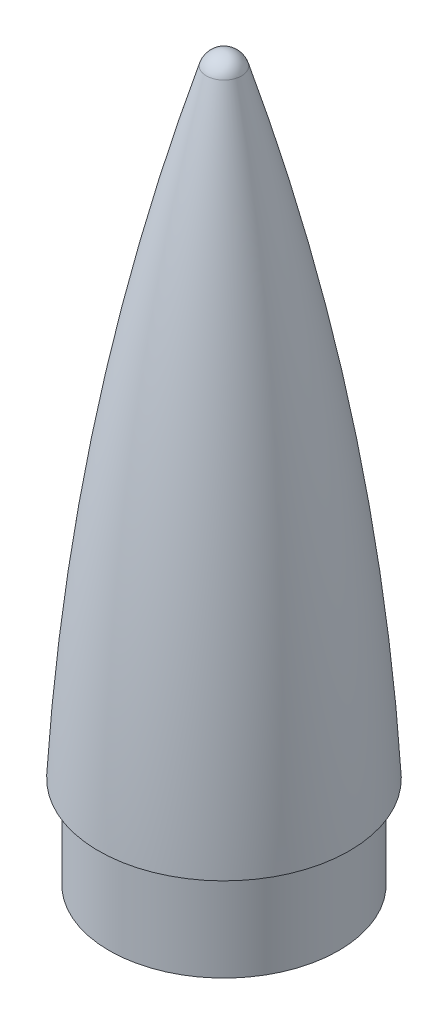
ISO-10303-21;
HEADER;
FILE_DESCRIPTION(('STEP AP214'),'2;1');
FILE_NAME('part.step','',(''),(''),'','','');
FILE_SCHEMA(('AUTOMOTIVE_DESIGN { 1 0 10303 214 1 1 1 1 }'));
ENDSEC;
DATA;
#1=APPLICATION_CONTEXT('core data for automotive mechanical design processes');
#2=APPLICATION_PROTOCOL_DEFINITION('international standard','automotive_design',2000,#1);
#3=PRODUCT_CONTEXT('',#1,'mechanical');
#4=PRODUCT('Part','Part','',(#3));
#5=PRODUCT_RELATED_PRODUCT_CATEGORY('part','',(#4));
#6=PRODUCT_DEFINITION_FORMATION('','',#4);
#7=PRODUCT_DEFINITION_CONTEXT('part definition',#1,'design');
#8=PRODUCT_DEFINITION('design','',#6,#7);
#9=PRODUCT_DEFINITION_SHAPE('','',#8);
#10=(LENGTH_UNIT() NAMED_UNIT(*) SI_UNIT(.MILLI.,.METRE.));
#11=(NAMED_UNIT(*) PLANE_ANGLE_UNIT() SI_UNIT($,.RADIAN.));
#12=(NAMED_UNIT(*) SI_UNIT($,.STERADIAN.) SOLID_ANGLE_UNIT());
#13=UNCERTAINTY_MEASURE_WITH_UNIT(LENGTH_MEASURE(1.E-05),#10,'distance_accuracy_value','');
#14=(GEOMETRIC_REPRESENTATION_CONTEXT(3) GLOBAL_UNCERTAINTY_ASSIGNED_CONTEXT((#13)) GLOBAL_UNIT_ASSIGNED_CONTEXT((#10,
#11,#12)) REPRESENTATION_CONTEXT('',''));
#15=CARTESIAN_POINT('',(0.,0.,0.));
#16=DIRECTION('',(0.,0.,1.));
#17=DIRECTION('',(1.,0.,0.));
#18=AXIS2_PLACEMENT_3D('',#15,#16,#17);
#19=CARTESIAN_POINT('',(0.,100.020689670783,0.));
#20=DIRECTION('',(0.,-1.,0.));
#21=DIRECTION('',(1.,0.,0.));
#22=AXIS2_PLACEMENT_3D('',#19,#20,#21);
#23=SPHERICAL_SURFACE('',#22,3.00000000000002);
#24=CARTESIAN_POINT('',(-3.46078550561241E-13,100.890212539573,0.));
#25=DIRECTION('',(0.,-1.,0.));
#26=DIRECTION('',(1.,0.,0.));
#27=AXIS2_PLACEMENT_3D('',#24,#25,#26);
#28=CIRCLE('',#27,2.87122447409642);
#29=CARTESIAN_POINT('',(2.87122447409608,100.890212539573,0.));
#30=VERTEX_POINT('',#29);
#31=EDGE_CURVE('E159',#30,#30,#28,.T.);
#32=ORIENTED_EDGE('',*,*,#31,.F.);
#33=EDGE_LOOP('',(#32));
#34=FACE_BOUND('',#33,.T.);
#35=ADVANCED_FACE('F53',(#34),#23,.T.);
#36=CARTESIAN_POINT('',(1.11022302462516E-13,-22.0000000000012,0.));
#37=DIRECTION('',(0.,-1.,0.));
#38=DIRECTION('',(1.,0.,0.));
#39=AXIS2_PLACEMENT_3D('',#36,#37,#38);
#40=DEGENERATE_TOROIDAL_SURFACE('',#39,402.920731707316,423.991882044408,.F.);
#41=CARTESIAN_POINT('',(0.,0.,0.));
#42=DIRECTION('',(0.,-1.,0.));
#43=DIRECTION('',(1.,0.,0.));
#44=AXIS2_PLACEMENT_3D('',#41,#42,#43);
#45=CIRCLE('',#44,20.5);
#46=CARTESIAN_POINT('',(20.5,0.,0.));
#47=VERTEX_POINT('',#46);
#48=EDGE_CURVE('E156',#47,#47,#45,.T.);
#49=ORIENTED_EDGE('',*,*,#48,.F.);
#50=EDGE_LOOP('',(#49));
#51=FACE_BOUND('',#50,.T.);
#52=ORIENTED_EDGE('',*,*,#31,.T.);
#53=EDGE_LOOP('',(#52));
#54=FACE_BOUND('',#53,.T.);
#55=ADVANCED_FACE('F214',(#51,#54),#40,.F.);
#56=CARTESIAN_POINT('',(-20.5,0.,0.));
#57=DIRECTION('',(0.,1.,0.));
#58=DIRECTION('',(-1.,0.,0.));
#59=AXIS2_PLACEMENT_3D('',#56,#57,#58);
#60=PLANE('',#59);
#61=CARTESIAN_POINT('',(0.,0.,0.));
#62=DIRECTION('',(0.,-1.,0.));
#63=DIRECTION('',(1.,0.,0.));
#64=AXIS2_PLACEMENT_3D('',#61,#62,#63);
#65=CIRCLE('',#64,18.75);
#66=CARTESIAN_POINT('',(18.75,0.,0.));
#67=VERTEX_POINT('',#66);
#68=EDGE_CURVE('E153',#67,#67,#65,.T.);
#69=ORIENTED_EDGE('',*,*,#68,.F.);
#70=EDGE_LOOP('',(#69));
#71=FACE_BOUND('',#70,.T.);
#72=ORIENTED_EDGE('',*,*,#48,.T.);
#73=EDGE_LOOP('',(#72));
#74=FACE_BOUND('',#73,.T.);
#75=ADVANCED_FACE('F219',(#71,#74),#60,.F.);
#76=CARTESIAN_POINT('',(3.43024899888577E-12,-1000.,0.));
#77=DIRECTION('',(0.,-1.,0.));
#78=DIRECTION('',(1.,0.,0.));
#79=AXIS2_PLACEMENT_3D('',#76,#77,#78);
#80=CYLINDRICAL_SURFACE('',#79,18.75);
#81=CARTESIAN_POINT('',(0.,-14.9999999999999,0.));
#82=DIRECTION('',(0.,-1.,0.));
#83=DIRECTION('',(1.,0.,0.));
#84=AXIS2_PLACEMENT_3D('',#81,#82,#83);
#85=CIRCLE('',#84,18.75);
#86=CARTESIAN_POINT('',(18.7500000000001,-14.9999999999998,0.));
#87=VERTEX_POINT('',#86);
#88=EDGE_CURVE('E150',#87,#87,#85,.T.);
#89=ORIENTED_EDGE('',*,*,#88,.F.);
#90=EDGE_LOOP('',(#89));
#91=FACE_BOUND('',#90,.T.);
#92=ORIENTED_EDGE('',*,*,#68,.T.);
#93=EDGE_LOOP('',(#92));
#94=FACE_BOUND('',#93,.T.);
#95=ADVANCED_FACE('F226',(#91,#94),#80,.T.);
#96=CARTESIAN_POINT('',(-18.75,-15.,0.));
#97=DIRECTION('',(0.,1.,0.));
#98=DIRECTION('',(-1.,0.,0.));
#99=AXIS2_PLACEMENT_3D('',#96,#97,#98);
#100=PLANE('',#99);
#101=CARTESIAN_POINT('',(0.,-14.9999999999999,0.));
#102=DIRECTION('',(0.,-1.,0.));
#103=DIRECTION('',(1.,0.,0.));
#104=AXIS2_PLACEMENT_3D('',#101,#102,#103);
#105=CIRCLE('',#104,17.25);
#106=CARTESIAN_POINT('',(17.2500000000001,-14.9999999999998,0.));
#107=VERTEX_POINT('',#106);
#108=EDGE_CURVE('E147',#107,#107,#105,.T.);
#109=ORIENTED_EDGE('',*,*,#108,.F.);
#110=EDGE_LOOP('',(#109));
#111=FACE_BOUND('',#110,.T.);
#112=ORIENTED_EDGE('',*,*,#88,.T.);
#113=EDGE_LOOP('',(#112));
#114=FACE_BOUND('',#113,.T.);
#115=ADVANCED_FACE('F233',(#111,#114),#100,.F.);
#116=CARTESIAN_POINT('',(3.43024899888577E-12,-1000.,0.));
#117=DIRECTION('',(0.,-1.,0.));
#118=DIRECTION('',(1.,0.,0.));
#119=AXIS2_PLACEMENT_3D('',#116,#117,#118);
#120=CYLINDRICAL_SURFACE('',#119,17.25);
#121=ORIENTED_EDGE('',*,*,#108,.T.);
#122=EDGE_LOOP('',(#121));
#123=FACE_BOUND('',#122,.T.);
#124=CARTESIAN_POINT('',(0.,-0.841559970322425,0.));
#125=DIRECTION('',(0.,-1.,0.));
#126=DIRECTION('',(1.,0.,0.));
#127=AXIS2_PLACEMENT_3D('',#124,#125,#126);
#128=CIRCLE('',#127,17.25);
#129=CARTESIAN_POINT('',(16.0844594594595,-0.841559970322373,6.23319050703604));
#130=VERTEX_POINT('',#129);
#131=CARTESIAN_POINT('',(-16.0844594594595,-0.841559970322255,6.23319050703601));
#132=VERTEX_POINT('',#131);
#133=EDGE_CURVE('E122',#130,#132,#128,.T.);
#134=ORIENTED_EDGE('',*,*,#133,.F.);
#135=DIRECTION('',(0.,-1.,0.));
#136=VECTOR('',#135,1.);
#137=CARTESIAN_POINT('',(16.0844594594595,25.0000000000001,6.23319050703604));
#138=LINE('',#137,#136);
#139=CARTESIAN_POINT('',(16.0844594594595,25.0000000000001,6.23319050703604));
#140=VERTEX_POINT('',#139);
#141=EDGE_CURVE('E116',#140,#130,#138,.T.);
#142=ORIENTED_EDGE('',*,*,#141,.F.);
#143=CARTESIAN_POINT('',(0.,25.0000000000001,0.));
#144=DIRECTION('',(0.,-1.,0.));
#145=DIRECTION('',(1.,0.,0.));
#146=AXIS2_PLACEMENT_3D('',#143,#144,#145);
#147=CIRCLE('',#146,17.25);
#148=CARTESIAN_POINT('',(16.0844594594595,25.0000000000001,-6.23319050703604));
#149=VERTEX_POINT('',#148);
#150=EDGE_CURVE('E119',#140,#149,#147,.F.);
#151=ORIENTED_EDGE('',*,*,#150,.T.);
#152=DIRECTION('',(0.,-1.,0.));
#153=VECTOR('',#152,1.);
#154=CARTESIAN_POINT('',(16.0844594594595,25.0000000000001,-6.23319050703604));
#155=LINE('',#154,#153);
#156=CARTESIAN_POINT('',(16.0844594594595,-0.841559970291041,-6.23319050703604));
#157=VERTEX_POINT('',#156);
#158=EDGE_CURVE('E124',#149,#157,#155,.T.);
#159=ORIENTED_EDGE('',*,*,#158,.T.);
#160=CARTESIAN_POINT('',(-16.0844594594595,-0.841559970322255,-6.23319050703601));
#161=VERTEX_POINT('',#160);
#162=EDGE_CURVE('E144',#161,#157,#128,.T.);
#163=ORIENTED_EDGE('',*,*,#162,.F.);
#164=DIRECTION('',(0.,-1.,0.));
#165=VECTOR('',#164,1.);
#166=CARTESIAN_POINT('',(-16.0844594594596,25.,-6.23319050703601));
#167=LINE('',#166,#165);
#168=CARTESIAN_POINT('',(-16.0844594594596,25.,-6.23319050703601));
#169=VERTEX_POINT('',#168);
#170=EDGE_CURVE('E141',#169,#161,#167,.T.);
#171=ORIENTED_EDGE('',*,*,#170,.F.);
#172=CARTESIAN_POINT('',(0.,25.0000000000001,0.));
#173=DIRECTION('',(0.,-1.,0.));
#174=DIRECTION('',(1.,0.,0.));
#175=AXIS2_PLACEMENT_3D('',#172,#173,#174);
#176=CIRCLE('',#175,17.25);
#177=CARTESIAN_POINT('',(-16.0844594594596,25.,6.23319050703601));
#178=VERTEX_POINT('',#177);
#179=EDGE_CURVE('E137',#169,#178,#176,.F.);
#180=ORIENTED_EDGE('',*,*,#179,.T.);
#181=DIRECTION('',(0.,-1.,0.));
#182=VECTOR('',#181,1.);
#183=CARTESIAN_POINT('',(-16.0844594594596,25.,6.23319050703601));
#184=LINE('',#183,#182);
#185=EDGE_CURVE('E140',#178,#132,#184,.T.);
#186=ORIENTED_EDGE('',*,*,#185,.T.);
#187=EDGE_LOOP('',(#134,#142,#151,#159,#163,#171,#180,#186));
#188=FACE_BOUND('',#187,.T.);
#189=ADVANCED_FACE('F117',(#123,#188),#120,.F.);
#190=CARTESIAN_POINT('',(-402.920731707316,-22.0000000000026,0.));
#191=DIRECTION('',(0.,0.,-1.));
#192=DIRECTION('',(1.,0.,0.));
#193=AXIS2_PLACEMENT_3D('',#190,#191,#192);
#194=CIRCLE('',#193,420.703129733962);
#195=TRIMMED_CURVE('',#194,(PARAMETER_VALUE(-0.291785713632589)),
(PARAMETER_VALUE(0.291785713632589)),.T.,.PARAMETER.);
#196=CARTESIAN_POINT('',(1.11022302462516E-13,-22.0000000000012,0.));
#197=DIRECTION('',(0.,-1.,0.));
#198=AXIS1_PLACEMENT('',#196,#197);
#199=SURFACE_OF_REVOLUTION('',#195,#198);
#200=CARTESIAN_POINT('',(0.,99.0206896707829,0.));
#201=VERTEX_POINT('',#200);
#202=VERTEX_LOOP('',#201);
#203=FACE_BOUND('',#202,.T.);
#204=CARTESIAN_POINT('',(0.,25.0000000000001,0.));
#205=DIRECTION('',(0.,-1.,0.));
#206=DIRECTION('',(1.,0.,0.));
#207=AXIS2_PLACEMENT_3D('',#204,#205,#206);
#208=CIRCLE('',#207,15.1487880713337);
#209=CARTESIAN_POINT('',(12.4046367583882,25.0000000000001,8.6954451825439));
#210=VERTEX_POINT('',#209);
#211=CARTESIAN_POINT('',(12.4046367583882,25.0000000000001,-8.6954451825439));
#212=VERTEX_POINT('',#211);
#213=EDGE_CURVE('E200',#210,#212,#208,.F.);
#214=ORIENTED_EDGE('',*,*,#213,.F.);
#215=CARTESIAN_POINT('',(12.4045999356467,25.0002000000001,8.69545854144664));
#216=CARTESIAN_POINT('',(12.5440591476588,24.2427533177603,8.64487182838234));
#217=CARTESIAN_POINT('',(12.6813124890261,23.4851035685339,8.5912746591864));
#218=CARTESIAN_POINT('',(12.9510907565841,21.9693775191174,8.47854736514527));
#219=CARTESIAN_POINT('',(13.0836157056788,21.2113012210114,8.41941726710609));
#220=CARTESIAN_POINT('',(13.3436200054016,19.6947052070918,8.29611245769831));
#221=CARTESIAN_POINT('',(13.4710994284541,18.9361854978017,8.23193781877947));
#222=CARTESIAN_POINT('',(13.720719497706,17.4186639305926,8.09908430951668));
#223=CARTESIAN_POINT('',(13.8428601398408,16.659662072307,8.03040543574368));
#224=CARTESIAN_POINT('',(14.2006469777253,14.3831589097682,7.81858654659928));
#225=CARTESIAN_POINT('',(14.4278797363729,12.8648728792549,7.66955768875358));
#226=CARTESIAN_POINT('',(14.8578215076155,9.82592016224904,7.361032741326));
#227=CARTESIAN_POINT('',(15.0605309055073,8.3052535135398,7.20153681625731));
#228=CARTESIAN_POINT('',(15.3290480370559,6.14896270866083,6.97269611978126));
#229=CARTESIAN_POINT('',(15.4057388822293,5.5145011312534,6.9050348317579));
#230=CARTESIAN_POINT('',(15.5544295184989,4.2450517195521,6.76954755405452));
#231=CARTESIAN_POINT('',(15.6264293629869,3.61006389133123,6.70172156625818));
#232=CARTESIAN_POINT('',(15.7656478163507,2.33929868206386,6.56644884260569));
#233=CARTESIAN_POINT('',(15.8328647610776,1.70352110376178,6.49900224619835));
#234=CARTESIAN_POINT('',(15.9623841804819,0.431350516956625,6.3651477678516));
#235=CARTESIAN_POINT('',(16.0246866089005,-0.205042497282283,6.29873989569409));
#236=CARTESIAN_POINT('',(16.0844782410895,-0.841759970322358,6.23316991362136));
#237=B_SPLINE_CURVE_WITH_KNOTS('',3,(#215,#216,#217,#218,#219,#220,#221,#222,#223,#224,#225,
#226,#227,#228,#229,#230,#231,#232,#233,#234,#235,#236),.UNSPECIFIED.,.F.,.F.,(4,2,2,2,2,2,2,2,
2,2,4),(0.,2.31550098369239,4.63099074979914,6.94644726688973,9.26190554674241,13.8888914106121,
18.5158045685375,20.4437459516298,22.3716653875424,24.3002523711627,26.2288575057752),.UNSPECIFIED.);
#238=EDGE_CURVE('E12',#210,#130,#237,.T.);
#239=ORIENTED_EDGE('',*,*,#238,.T.);
#240=ORIENTED_EDGE('',*,*,#133,.T.);
#241=CARTESIAN_POINT('',(-16.0844782410894,-0.841759970322366,6.2331699136214));
#242=CARTESIAN_POINT('',(-16.0126968937028,-0.0773544463921359,6.31189747482542));
#243=CARTESIAN_POINT('',(-15.937295345738,0.686583424783676,6.39182107419193));
#244=CARTESIAN_POINT('',(-15.7794393963888,2.21358646153243,6.55298185130604));
#245=CARTESIAN_POINT('',(-15.6969850454683,2.97665163331008,6.63421901965151));
#246=CARTESIAN_POINT('',(-15.5252087668279,4.50199380605983,6.79693076742449));
#247=CARTESIAN_POINT('',(-15.4358867400836,5.26427079550651,6.87840535025897));
#248=CARTESIAN_POINT('',(-15.2505809078376,6.78808891981179,7.04064656677114));
#249=CARTESIAN_POINT('',(-15.154597093294,7.54963005367021,7.12141319948777));
#250=CARTESIAN_POINT('',(-14.8571440343893,9.83193294798788,7.36119321107573));
#251=CARTESIAN_POINT('',(-14.6460234031512,11.3516973317238,7.51783097578239));
#252=CARTESIAN_POINT('',(-14.1999315444354,14.3889106429346,7.81876630720008));
#253=CARTESIAN_POINT('',(-13.9649609534836,15.906359631108,7.96306420305765));
#254=CARTESIAN_POINT('',(-13.6166932905167,18.0547881663623,8.15525693603032));
#255=CARTESIAN_POINT('',(-13.5123621636293,18.6865966995118,8.21029170781872));
#256=CARTESIAN_POINT('',(-13.3001004914423,19.9498858872203,8.3170482054586));
#257=CARTESIAN_POINT('',(-13.1921699731369,20.5813665442023,8.36876995614823));
#258=CARTESIAN_POINT('',(-12.9728444219897,21.8442414082946,8.46861565810908));
#259=CARTESIAN_POINT('',(-12.8614481801267,22.4756355062791,8.51673833345192));
#260=CARTESIAN_POINT('',(-12.6354111128587,23.738133475005,8.60908894685449));
#261=CARTESIAN_POINT('',(-12.5207702581773,24.3692373430755,8.65331684975635));
#262=CARTESIAN_POINT('',(-12.4045999356468,25.0002,8.69545854144666));
#263=B_SPLINE_CURVE_WITH_KNOTS('',3,(#241,#242,#243,#244,#245,#246,#247,#248,#249,#250,#251,
#252,#253,#254,#255,#256,#257,#258,#259,#260,#261,#262),.UNSPECIFIED.,.F.,.F.,(4,2,2,2,2,2,2,2,
2,2,4),(0.,2.31536687200156,4.63071717860638,6.9461008763691,9.26148771679521,13.888243827361,
18.5148764879858,20.443037874753,22.3711848041483,24.3000120830123,26.2288567715011),.UNSPECIFIED.);
#264=CARTESIAN_POINT('',(-12.4046367583882,25.,8.69544518254392));
#265=VERTEX_POINT('',#264);
#266=EDGE_CURVE('E164',#132,#265,#263,.T.);
#267=ORIENTED_EDGE('',*,*,#266,.T.);
#268=CARTESIAN_POINT('',(0.,25.0000000000001,0.));
#269=DIRECTION('',(0.,-1.,0.));
#270=DIRECTION('',(1.,0.,0.));
#271=AXIS2_PLACEMENT_3D('',#268,#269,#270);
#272=CIRCLE('',#271,15.1487880713337);
#273=CARTESIAN_POINT('',(-12.4046367583882,25.,-8.69544518254392));
#274=VERTEX_POINT('',#273);
#275=EDGE_CURVE('E162',#274,#265,#272,.F.);
#276=ORIENTED_EDGE('',*,*,#275,.F.);
#277=CARTESIAN_POINT('',(-12.4045999356466,25.0002,-8.69545854144672));
#278=CARTESIAN_POINT('',(-12.5440591476589,24.2427533177601,-8.64487182838237));
#279=CARTESIAN_POINT('',(-12.6813124890261,23.4851035685338,-8.59127465918642));
#280=CARTESIAN_POINT('',(-12.9510907565842,21.9693775191172,-8.4785473651453));
#281=CARTESIAN_POINT('',(-13.0836157056789,21.2113012210113,-8.41941726710612));
#282=CARTESIAN_POINT('',(-13.3436200054017,19.6947052070917,-8.29611245769835));
#283=CARTESIAN_POINT('',(-13.4710994284541,18.9361854978016,-8.2319378187795));
#284=CARTESIAN_POINT('',(-13.720719497706,17.4186639305925,-8.09908430951669));
#285=CARTESIAN_POINT('',(-13.8428601398409,16.6596620723069,-8.03040543574368));
#286=CARTESIAN_POINT('',(-14.2006469777254,14.3831589097681,-7.81858654659928));
#287=CARTESIAN_POINT('',(-14.427879736373,12.8648728792548,-7.6695576887536));
#288=CARTESIAN_POINT('',(-14.8578215076156,9.82592016224894,-7.36103274132599));
#289=CARTESIAN_POINT('',(-15.0605309055074,8.30525351353971,-7.20153681625725));
#290=CARTESIAN_POINT('',(-15.3290480370559,6.14896270866072,-6.97269611978131));
#291=CARTESIAN_POINT('',(-15.4057388822292,5.51450113125328,-6.90503483175802));
#292=CARTESIAN_POINT('',(-15.5544295184988,4.245051719552,-6.76954755405463));
#293=CARTESIAN_POINT('',(-15.6264293629868,3.61006389133115,-6.70172156625822));
#294=CARTESIAN_POINT('',(-15.7656478163506,2.33929868206381,-6.56644884260571));
#295=CARTESIAN_POINT('',(-15.8328647610776,1.70352110376173,-6.49900224619841));
#296=CARTESIAN_POINT('',(-15.9623841804818,0.431350516956584,-6.36514776785173));
#297=CARTESIAN_POINT('',(-16.0246866089004,-0.205042497282318,-6.29873989569422));
#298=CARTESIAN_POINT('',(-16.0844782410894,-0.841759970322367,-6.23316991362141));
#299=B_SPLINE_CURVE_WITH_KNOTS('',3,(#277,#278,#279,#280,#281,#282,#283,#284,#285,#286,#287,
#288,#289,#290,#291,#292,#293,#294,#295,#296,#297,#298),.UNSPECIFIED.,.F.,.F.,(4,2,2,2,2,2,2,2,
2,2,4),(0.,2.31550098369239,4.63099074979915,6.94644726688973,9.2619055467424,13.888891410612,
18.5158045685375,20.4437459516297,22.3716653875423,24.3002523711625,26.228857505775),.UNSPECIFIED.);
#300=EDGE_CURVE('E172',#274,#161,#299,.T.);
#301=ORIENTED_EDGE('',*,*,#300,.T.);
#302=ORIENTED_EDGE('',*,*,#162,.T.);
#303=CARTESIAN_POINT('',(16.0844782410895,-0.841759970322351,-6.23316991362133));
#304=CARTESIAN_POINT('',(16.0126968937029,-0.0773544463921211,-6.31189747482536));
#305=CARTESIAN_POINT('',(15.9372953457381,0.686583424783693,-6.39182107419185));
#306=CARTESIAN_POINT('',(15.7794393963889,2.21358646153246,-6.55298185130593));
#307=CARTESIAN_POINT('',(15.6969850454684,2.97665163331012,-6.63421901965137));
#308=CARTESIAN_POINT('',(15.5252087668281,4.50199380605988,-6.79693076742433));
#309=CARTESIAN_POINT('',(15.4358867400838,5.26427079550656,-6.87840535025881));
#310=CARTESIAN_POINT('',(15.2505809078377,6.78808891981184,-7.04064656677097));
#311=CARTESIAN_POINT('',(15.1545970932942,7.54963005367026,-7.12141319948761));
#312=CARTESIAN_POINT('',(14.8571440343894,9.83193294798792,-7.3611932110756));
#313=CARTESIAN_POINT('',(14.6460234031512,11.3516973317238,-7.51783097578232));
#314=CARTESIAN_POINT('',(14.1999315444353,14.3889106429346,-7.81876630720007));
#315=CARTESIAN_POINT('',(13.9649609534835,15.906359631108,-7.96306420305763));
#316=CARTESIAN_POINT('',(13.6166932905166,18.0547881663624,-8.1552569360303));
#317=CARTESIAN_POINT('',(13.5123621636293,18.6865966995118,-8.21029170781869));
#318=CARTESIAN_POINT('',(13.3001004914422,19.9498858872204,-8.31704820545857));
#319=CARTESIAN_POINT('',(13.1921699731368,20.5813665442024,-8.36876995614821));
#320=CARTESIAN_POINT('',(12.9728444219896,21.8442414082947,-8.46861565810904));
#321=CARTESIAN_POINT('',(12.8614481801267,22.4756355062792,-8.51673833345186));
#322=CARTESIAN_POINT('',(12.6354111128587,23.7381334750051,-8.60908894685444));
#323=CARTESIAN_POINT('',(12.5207702581772,24.3692373430756,-8.65331684975632));
#324=CARTESIAN_POINT('',(12.4045999356466,25.0002000000001,-8.69545854144669));
#325=B_SPLINE_CURVE_WITH_KNOTS('',3,(#303,#304,#305,#306,#307,#308,#309,#310,#311,#312,#313,
#314,#315,#316,#317,#318,#319,#320,#321,#322,#323,#324),.UNSPECIFIED.,.F.,.F.,(4,2,2,2,2,2,2,2,
2,2,4),(0.,2.31536687200156,4.63071717860639,6.94610087636911,9.26148771679522,13.888243827361,
18.5148764879859,20.443037874753,22.3711848041484,24.3000120830124,26.2288567715013),.UNSPECIFIED.);
#326=EDGE_CURVE('E66',#157,#212,#325,.T.);
#327=ORIENTED_EDGE('',*,*,#326,.T.);
#328=EDGE_LOOP('',(#214,#239,#240,#267,#276,#301,#302,#327));
#329=FACE_BOUND('',#328,.T.);
#330=ADVANCED_FACE('F178',(#203,#329),#199,.F.);
#331=CARTESIAN_POINT('',(-9.25000000000009,25.,0.));
#332=DIRECTION('',(0.,-1.,0.));
#333=DIRECTION('',(1.,0.,0.));
#334=AXIS2_PLACEMENT_3D('',#331,#332,#333);
#335=CYLINDRICAL_SURFACE('',#334,9.25);
#336=CARTESIAN_POINT('',(-9.25000000000009,25.,0.));
#337=DIRECTION('',(0.,-1.,0.));
#338=DIRECTION('',(1.,0.,0.));
#339=AXIS2_PLACEMENT_3D('',#336,#337,#338);
#340=CIRCLE('',#339,9.25);
#341=EDGE_CURVE('E81',#169,#274,#340,.T.);
#342=ORIENTED_EDGE('',*,*,#341,.F.);
#343=ORIENTED_EDGE('',*,*,#170,.T.);
#344=ORIENTED_EDGE('',*,*,#300,.F.);
#345=EDGE_LOOP('',(#342,#343,#344));
#346=FACE_BOUND('',#345,.T.);
#347=ADVANCED_FACE('F181',(#346),#335,.F.);
#348=ORIENTED_EDGE('',*,*,#185,.F.);
#349=EDGE_CURVE('E134',#265,#178,#340,.T.);
#350=ORIENTED_EDGE('',*,*,#349,.F.);
#351=ORIENTED_EDGE('',*,*,#266,.F.);
#352=EDGE_LOOP('',(#348,#350,#351));
#353=FACE_BOUND('',#352,.T.);
#354=ADVANCED_FACE('F185',(#353),#335,.F.);
#355=CARTESIAN_POINT('',(0.,25.0000000000001,0.));
#356=DIRECTION('',(0.,-1.,0.));
#357=DIRECTION('',(1.,0.,0.));
#358=AXIS2_PLACEMENT_3D('',#355,#356,#357);
#359=PLANE('',#358);
#360=ORIENTED_EDGE('',*,*,#275,.T.);
#361=ORIENTED_EDGE('',*,*,#349,.T.);
#362=ORIENTED_EDGE('',*,*,#179,.F.);
#363=ORIENTED_EDGE('',*,*,#341,.T.);
#364=EDGE_LOOP('',(#360,#361,#362,#363));
#365=FACE_BOUND('',#364,.T.);
#366=ADVANCED_FACE('F187',(#365),#359,.T.);
#367=CARTESIAN_POINT('',(9.24999999999991,25.0000000000001,0.));
#368=DIRECTION('',(0.,-1.,0.));
#369=DIRECTION('',(1.,0.,0.));
#370=AXIS2_PLACEMENT_3D('',#367,#368,#369);
#371=CYLINDRICAL_SURFACE('',#370,9.25000000000001);
#372=CARTESIAN_POINT('',(9.24999999999991,25.0000000000001,0.));
#373=DIRECTION('',(0.,-1.,0.));
#374=DIRECTION('',(1.,0.,0.));
#375=AXIS2_PLACEMENT_3D('',#372,#373,#374);
#376=CIRCLE('',#375,9.25000000000001);
#377=EDGE_CURVE('E73',#140,#210,#376,.T.);
#378=ORIENTED_EDGE('',*,*,#377,.F.);
#379=ORIENTED_EDGE('',*,*,#141,.T.);
#380=ORIENTED_EDGE('',*,*,#238,.F.);
#381=EDGE_LOOP('',(#378,#379,#380));
#382=FACE_BOUND('',#381,.T.);
#383=ADVANCED_FACE('F130',(#382),#371,.F.);
#384=ORIENTED_EDGE('',*,*,#158,.F.);
#385=EDGE_CURVE('E128',#212,#149,#376,.T.);
#386=ORIENTED_EDGE('',*,*,#385,.F.);
#387=ORIENTED_EDGE('',*,*,#326,.F.);
#388=EDGE_LOOP('',(#384,#386,#387));
#389=FACE_BOUND('',#388,.T.);
#390=ADVANCED_FACE('F193',(#389),#371,.F.);
#391=CARTESIAN_POINT('',(0.,25.0000000000001,0.));
#392=DIRECTION('',(0.,-1.,0.));
#393=DIRECTION('',(1.,0.,0.));
#394=AXIS2_PLACEMENT_3D('',#391,#392,#393);
#395=PLANE('',#394);
#396=ORIENTED_EDGE('',*,*,#213,.T.);
#397=ORIENTED_EDGE('',*,*,#385,.T.);
#398=ORIENTED_EDGE('',*,*,#150,.F.);
#399=ORIENTED_EDGE('',*,*,#377,.T.);
#400=EDGE_LOOP('',(#396,#397,#398,#399));
#401=FACE_BOUND('',#400,.T.);
#402=ADVANCED_FACE('F126',(#401),#395,.T.);
#403=CLOSED_SHELL('',(#35,#55,#75,#95,#115,#189,#330,#347,#354,#366,#383,#390,#402));
#404=MANIFOLD_SOLID_BREP('B2',#403);
#405=ADVANCED_BREP_SHAPE_REPRESENTATION('',(#18,#404),#14);
#406=SHAPE_DEFINITION_REPRESENTATION(#9,#405);
ENDSEC;
END-ISO-10303-21;
